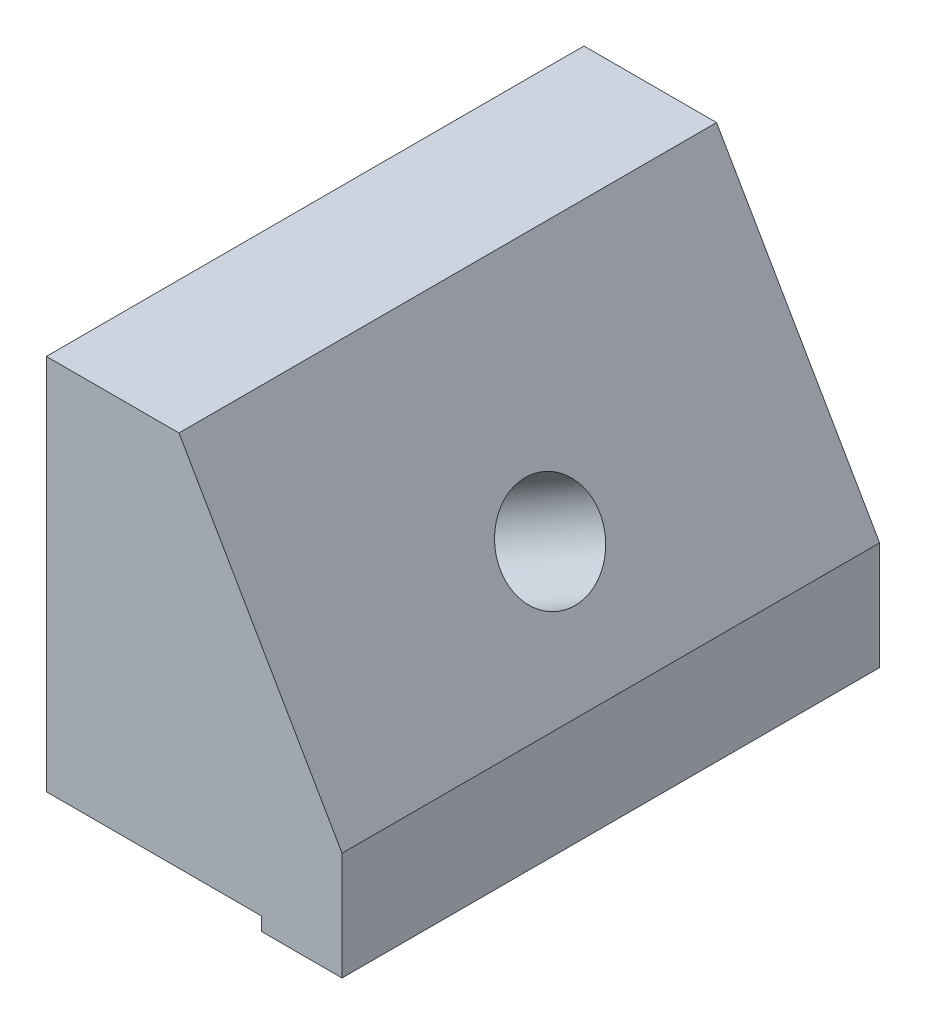
ISO-10303-21;
HEADER;
FILE_DESCRIPTION(('STEP AP214'),'2;1');
FILE_NAME('part.step','',(''),(''),'','','');
FILE_SCHEMA(('AUTOMOTIVE_DESIGN { 1 0 10303 214 1 1 1 1 }'));
ENDSEC;
DATA;
#1=APPLICATION_CONTEXT('core data for automotive mechanical design processes');
#2=APPLICATION_PROTOCOL_DEFINITION('international standard','automotive_design',2000,#1);
#3=PRODUCT_CONTEXT('',#1,'mechanical');
#4=PRODUCT('Part','Part','',(#3));
#5=PRODUCT_RELATED_PRODUCT_CATEGORY('part','',(#4));
#6=PRODUCT_DEFINITION_FORMATION('','',#4);
#7=PRODUCT_DEFINITION_CONTEXT('part definition',#1,'design');
#8=PRODUCT_DEFINITION('design','',#6,#7);
#9=PRODUCT_DEFINITION_SHAPE('','',#8);
#10=(LENGTH_UNIT() NAMED_UNIT(*) SI_UNIT(.MILLI.,.METRE.));
#11=(NAMED_UNIT(*) PLANE_ANGLE_UNIT() SI_UNIT($,.RADIAN.));
#12=(NAMED_UNIT(*) SI_UNIT($,.STERADIAN.) SOLID_ANGLE_UNIT());
#13=UNCERTAINTY_MEASURE_WITH_UNIT(LENGTH_MEASURE(1.E-05),#10,'distance_accuracy_value','');
#14=(GEOMETRIC_REPRESENTATION_CONTEXT(3) GLOBAL_UNCERTAINTY_ASSIGNED_CONTEXT((#13)) GLOBAL_UNIT_ASSIGNED_CONTEXT((#10,
#11,#12)) REPRESENTATION_CONTEXT('',''));
#15=CARTESIAN_POINT('',(0.,0.,0.));
#16=DIRECTION('',(0.,0.,1.));
#17=DIRECTION('',(1.,0.,0.));
#18=AXIS2_PLACEMENT_3D('',#15,#16,#17);
#19=CARTESIAN_POINT('',(-3.75,7.39519052838329,0.));
#20=DIRECTION('',(0.,1.,0.));
#21=DIRECTION('',(0.,0.,1.));
#22=AXIS2_PLACEMENT_3D('',#19,#20,#21);
#23=PLANE('',#22);
#24=DIRECTION('',(0.,0.,1.));
#25=VECTOR('',#24,1.);
#26=CARTESIAN_POINT('',(-3.75,7.39519052838329,0.));
#27=LINE('',#26,#25);
#28=CARTESIAN_POINT('',(-3.75,7.39519052838329,11.5059983692698));
#29=VERTEX_POINT('',#28);
#30=CARTESIAN_POINT('',(-3.75,7.39519052838329,13.));
#31=VERTEX_POINT('',#30);
#32=EDGE_CURVE('E277',#29,#31,#27,.T.);
#33=ORIENTED_EDGE('',*,*,#32,.F.);
#34=DIRECTION('',(1.,0.,0.));
#35=VECTOR('',#34,1.);
#36=CARTESIAN_POINT('',(-3.75,7.39519052838329,11.5059983692698));
#37=LINE('',#36,#35);
#38=CARTESIAN_POINT('',(0.250000000000003,7.39519052838329,11.5059983692698));
#39=VERTEX_POINT('',#38);
#40=EDGE_CURVE('E12',#29,#39,#37,.T.);
#41=ORIENTED_EDGE('',*,*,#40,.T.);
#42=DIRECTION('',(0.,0.,1.));
#43=VECTOR('',#42,1.);
#44=CARTESIAN_POINT('',(0.250000000000003,7.39519052838329,0.));
#45=LINE('',#44,#43);
#46=CARTESIAN_POINT('',(0.250000000000003,7.39519052838329,13.));
#47=VERTEX_POINT('',#46);
#48=EDGE_CURVE('E290',#39,#47,#45,.T.);
#49=ORIENTED_EDGE('',*,*,#48,.T.);
#50=DIRECTION('',(-1.,0.,0.));
#51=VECTOR('',#50,1.);
#52=CARTESIAN_POINT('',(-3.75,7.39519052838329,13.));
#53=LINE('',#52,#51);
#54=EDGE_CURVE('E280',#47,#31,#53,.T.);
#55=ORIENTED_EDGE('',*,*,#54,.T.);
#56=EDGE_LOOP('',(#33,#41,#49,#55));
#57=FACE_BOUND('',#56,.T.);
#58=ADVANCED_FACE('F42',(#57),#23,.F.);
#59=CARTESIAN_POINT('',(12.9903810567666,7.5,20.));
#60=DIRECTION('',(-0.866025403784438,-0.5,0.));
#61=DIRECTION('',(0.5,-0.866025403784438,0.));
#62=AXIS2_PLACEMENT_3D('',#59,#60,#61);
#63=PLANE('',#62);
#64=CARTESIAN_POINT('',(8.99038105676658,14.4282032302755,10.));
#65=DIRECTION('',(0.866025403784438,0.5,0.));
#66=DIRECTION('',(-0.5,0.866025403784439,0.));
#67=AXIS2_PLACEMENT_3D('',#64,#65,#66);
#68=CIRCLE('',#67,1.85);
#69=CARTESIAN_POINT('',(8.06538105676657,16.0303502272767,10.));
#70=VERTEX_POINT('',#69);
#71=EDGE_CURVE('E321',#70,#70,#68,.T.);
#72=ORIENTED_EDGE('',*,*,#71,.F.);
#73=EDGE_LOOP('',(#72));
#74=FACE_BOUND('',#73,.T.);
#75=DIRECTION('',(-0.5,0.866025403784439,0.));
#76=VECTOR('',#75,1.);
#77=CARTESIAN_POINT('',(12.9903810567666,7.5,0.));
#78=LINE('',#77,#76);
#79=CARTESIAN_POINT('',(11.25,10.5144284148501,0.));
#80=VERTEX_POINT('',#79);
#81=CARTESIAN_POINT('',(5.18317671461293,21.0224745856825,0.));
#82=VERTEX_POINT('',#81);
#83=EDGE_CURVE('E326',#80,#82,#78,.T.);
#84=ORIENTED_EDGE('',*,*,#83,.T.);
#85=DIRECTION('',(0.,0.,1.));
#86=VECTOR('',#85,1.);
#87=CARTESIAN_POINT('',(5.18317671461293,21.0224745856825,0.));
#88=LINE('',#87,#86);
#89=CARTESIAN_POINT('',(5.18317671461293,21.0224745856825,20.));
#90=VERTEX_POINT('',#89);
#91=EDGE_CURVE('E377',#82,#90,#88,.T.);
#92=ORIENTED_EDGE('',*,*,#91,.T.);
#93=DIRECTION('',(-0.5,0.866025403784439,0.));
#94=VECTOR('',#93,1.);
#95=CARTESIAN_POINT('',(12.9903810567666,7.5,20.));
#96=LINE('',#95,#94);
#97=CARTESIAN_POINT('',(11.25,10.5144284148501,20.));
#98=VERTEX_POINT('',#97);
#99=EDGE_CURVE('E330',#98,#90,#96,.T.);
#100=ORIENTED_EDGE('',*,*,#99,.F.);
#101=DIRECTION('',(0.,0.,1.));
#102=VECTOR('',#101,1.);
#103=CARTESIAN_POINT('',(11.25,10.5144284148501,0.));
#104=LINE('',#103,#102);
#105=EDGE_CURVE('E311',#80,#98,#104,.T.);
#106=ORIENTED_EDGE('',*,*,#105,.F.);
#107=EDGE_LOOP('',(#84,#92,#100,#106));
#108=FACE_BOUND('',#107,.T.);
#109=ADVANCED_FACE('F44',(#74,#108),#63,.F.);
#110=CARTESIAN_POINT('',(0.,0.,20.));
#111=DIRECTION('',(0.,0.,1.));
#112=DIRECTION('',(1.,0.,0.));
#113=AXIS2_PLACEMENT_3D('',#110,#111,#112);
#114=PLANE('',#113);
#115=DIRECTION('',(-1.,0.,0.));
#116=VECTOR('',#115,1.);
#117=CARTESIAN_POINT('',(0.250000000000003,6.99519052838329,20.));
#118=LINE('',#117,#116);
#119=CARTESIAN_POINT('',(8.25,6.99519052838329,20.));
#120=VERTEX_POINT('',#119);
#121=CARTESIAN_POINT('',(0.250000000000003,6.99519052838329,20.));
#122=VERTEX_POINT('',#121);
#123=EDGE_CURVE('E361',#120,#122,#118,.T.);
#124=ORIENTED_EDGE('',*,*,#123,.F.);
#125=DIRECTION('',(0.,1.,0.));
#126=VECTOR('',#125,1.);
#127=CARTESIAN_POINT('',(8.25,6.49519052838329,20.));
#128=LINE('',#127,#126);
#129=CARTESIAN_POINT('',(8.25,6.49519052838329,20.));
#130=VERTEX_POINT('',#129);
#131=EDGE_CURVE('E381',#130,#120,#128,.T.);
#132=ORIENTED_EDGE('',*,*,#131,.F.);
#133=DIRECTION('',(1.,0.,0.));
#134=VECTOR('',#133,1.);
#135=CARTESIAN_POINT('',(-3.75,6.49519052838329,20.));
#136=LINE('',#135,#134);
#137=CARTESIAN_POINT('',(11.25,6.49519052838329,20.));
#138=VERTEX_POINT('',#137);
#139=EDGE_CURVE('E304',#130,#138,#136,.T.);
#140=ORIENTED_EDGE('',*,*,#139,.T.);
#141=DIRECTION('',(0.,1.,0.));
#142=VECTOR('',#141,1.);
#143=CARTESIAN_POINT('',(11.25,6.49519052838329,20.));
#144=LINE('',#143,#142);
#145=EDGE_CURVE('E300',#138,#98,#144,.T.);
#146=ORIENTED_EDGE('',*,*,#145,.T.);
#147=ORIENTED_EDGE('',*,*,#99,.T.);
#148=DIRECTION('',(1.,0.,0.));
#149=VECTOR('',#148,1.);
#150=CARTESIAN_POINT('',(0.250000000000001,21.0224745856825,20.));
#151=LINE('',#150,#149);
#152=CARTESIAN_POINT('',(0.250000000000001,21.0224745856825,20.));
#153=VERTEX_POINT('',#152);
#154=EDGE_CURVE('E374',#153,#90,#151,.T.);
#155=ORIENTED_EDGE('',*,*,#154,.F.);
#156=DIRECTION('',(0.,1.,0.));
#157=VECTOR('',#156,1.);
#158=CARTESIAN_POINT('',(0.25,26.7024499500202,20.));
#159=LINE('',#158,#157);
#160=EDGE_CURVE('E288',#122,#153,#159,.T.);
#161=ORIENTED_EDGE('',*,*,#160,.F.);
#162=EDGE_LOOP('',(#124,#132,#140,#146,#147,#155,#161));
#163=FACE_BOUND('',#162,.T.);
#164=ADVANCED_FACE('F273',(#163),#114,.T.);
#165=CARTESIAN_POINT('',(0.,0.,0.));
#166=DIRECTION('',(0.,0.,1.));
#167=DIRECTION('',(1.,0.,0.));
#168=AXIS2_PLACEMENT_3D('',#165,#166,#167);
#169=PLANE('',#168);
#170=DIRECTION('',(0.,1.,0.));
#171=VECTOR('',#170,1.);
#172=CARTESIAN_POINT('',(8.25,6.49519052838329,0.));
#173=LINE('',#172,#171);
#174=CARTESIAN_POINT('',(8.25,6.49519052838329,0.));
#175=VERTEX_POINT('',#174);
#176=CARTESIAN_POINT('',(8.25,6.99519052838329,0.));
#177=VERTEX_POINT('',#176);
#178=EDGE_CURVE('E430',#175,#177,#173,.T.);
#179=ORIENTED_EDGE('',*,*,#178,.T.);
#180=DIRECTION('',(-1.,0.,0.));
#181=VECTOR('',#180,1.);
#182=CARTESIAN_POINT('',(0.250000000000003,6.99519052838329,0.));
#183=LINE('',#182,#181);
#184=CARTESIAN_POINT('',(0.250000000000003,6.99519052838329,0.));
#185=VERTEX_POINT('',#184);
#186=EDGE_CURVE('E368',#177,#185,#183,.T.);
#187=ORIENTED_EDGE('',*,*,#186,.T.);
#188=DIRECTION('',(0.,1.,0.));
#189=VECTOR('',#188,1.);
#190=CARTESIAN_POINT('',(0.25,26.7024499500202,0.));
#191=LINE('',#190,#189);
#192=CARTESIAN_POINT('',(0.250000000000001,21.0224745856825,0.));
#193=VERTEX_POINT('',#192);
#194=EDGE_CURVE('E346',#185,#193,#191,.T.);
#195=ORIENTED_EDGE('',*,*,#194,.T.);
#196=DIRECTION('',(1.,0.,0.));
#197=VECTOR('',#196,1.);
#198=CARTESIAN_POINT('',(0.250000000000001,21.0224745856825,0.));
#199=LINE('',#198,#197);
#200=EDGE_CURVE('E369',#193,#82,#199,.T.);
#201=ORIENTED_EDGE('',*,*,#200,.T.);
#202=ORIENTED_EDGE('',*,*,#83,.F.);
#203=DIRECTION('',(0.,1.,0.));
#204=VECTOR('',#203,1.);
#205=CARTESIAN_POINT('',(11.25,6.49519052838329,0.));
#206=LINE('',#205,#204);
#207=CARTESIAN_POINT('',(11.25,6.49519052838329,0.));
#208=VERTEX_POINT('',#207);
#209=EDGE_CURVE('E299',#208,#80,#206,.T.);
#210=ORIENTED_EDGE('',*,*,#209,.F.);
#211=DIRECTION('',(1.,0.,0.));
#212=VECTOR('',#211,1.);
#213=CARTESIAN_POINT('',(-3.75,6.49519052838329,0.));
#214=LINE('',#213,#212);
#215=EDGE_CURVE('E296',#175,#208,#214,.T.);
#216=ORIENTED_EDGE('',*,*,#215,.F.);
#217=EDGE_LOOP('',(#179,#187,#195,#201,#202,#210,#216));
#218=FACE_BOUND('',#217,.T.);
#219=ADVANCED_FACE('F434',(#218),#169,.F.);
#220=CARTESIAN_POINT('',(-13.375,1.51554445662277,10.));
#221=DIRECTION('',(0.866025403784439,0.5,0.));
#222=DIRECTION('',(-0.5,0.866025403784438,0.));
#223=AXIS2_PLACEMENT_3D('',#220,#221,#222);
#224=CYLINDRICAL_SURFACE('',#223,1.125);
#225=CARTESIAN_POINT('',(-0.419872981077809,8.99519052838329,10.));
#226=DIRECTION('',(0.,1.,0.));
#227=DIRECTION('',(1.,0.,0.));
#228=AXIS2_PLACEMENT_3D('',#225,#226,#227);
#229=ELLIPSE('',#228,2.25,1.125);
#230=CARTESIAN_POINT('',(1.7126363541341,8.99519052838329,10.3587840350524));
#231=VERTEX_POINT('',#230);
#232=CARTESIAN_POINT('',(1.7126363541341,8.99519052838329,9.64121596494755));
#233=VERTEX_POINT('',#232);
#234=EDGE_CURVE('E206',#231,#233,#229,.F.);
#235=ORIENTED_EDGE('',*,*,#234,.T.);
#236=CARTESIAN_POINT('',(1.7126363541341,8.99519052838329,9.64121596494755));
#237=CARTESIAN_POINT('',(1.71983511216995,8.98794837620146,9.67055036186476));
#238=CARTESIAN_POINT('',(1.72619402285769,8.98161689764097,9.70030341076179));
#239=CARTESIAN_POINT('',(1.73714059274333,8.97078817170904,9.76046351455106));
#240=CARTESIAN_POINT('',(1.74172814570919,8.96629103434596,9.79087060855234));
#241=CARTESIAN_POINT('',(1.75248692693685,8.95577523451789,9.88104640997816));
#242=CARTESIAN_POINT('',(1.75607201054902,8.9523209212232,9.94146334965415));
#243=CARTESIAN_POINT('',(1.75592315514308,8.95246526607113,10.0616716861273));
#244=CARTESIAN_POINT('',(1.75226214223061,8.95599364897395,10.1214632890588));
#245=CARTESIAN_POINT('',(1.74150049026233,8.96651417365043,10.2106989236111));
#246=CARTESIAN_POINT('',(1.73693266403881,8.97099304744882,10.2407834606934));
#247=CARTESIAN_POINT('',(1.72606279533413,8.98174750153817,10.3003101177295));
#248=CARTESIAN_POINT('',(1.71976083406143,8.98802299769498,10.3297522676961));
#249=CARTESIAN_POINT('',(1.7126363541341,8.99519052838329,10.3587840350524));
#250=B_SPLINE_CURVE_WITH_KNOTS('',3,(#236,#237,#238,#239,#240,#241,#242,#243,#244,#245,#246,
#247,#248,#249),.UNSPECIFIED.,.F.,.F.,(4,2,2,2,2,2,4),(0.,0.0931310394863526,0.18626766336891,
0.367233092904823,0.546386511271815,0.638562582483938,0.730734337882146),.UNSPECIFIED.);
#251=EDGE_CURVE('E196',#233,#231,#250,.T.);
#252=ORIENTED_EDGE('',*,*,#251,.T.);
#253=EDGE_LOOP('',(#235,#252));
#254=FACE_BOUND('',#253,.T.);
#255=CARTESIAN_POINT('',(3.79422863405995,11.4282032302755,10.));
#256=DIRECTION('',(0.866025403784438,0.5,0.));
#257=DIRECTION('',(-0.5,0.866025403784439,0.));
#258=AXIS2_PLACEMENT_3D('',#255,#256,#257);
#259=CIRCLE('',#258,1.125);
#260=CARTESIAN_POINT('',(3.23172863405995,12.402481809533,10.));
#261=VERTEX_POINT('',#260);
#262=EDGE_CURVE('E314',#261,#261,#259,.T.);
#263=ORIENTED_EDGE('',*,*,#262,.T.);
#264=EDGE_LOOP('',(#263));
#265=FACE_BOUND('',#264,.T.);
#266=ADVANCED_FACE('F209',(#254,#265),#224,.F.);
#267=CARTESIAN_POINT('',(3.79422863405995,11.4282032302755,10.));
#268=DIRECTION('',(0.866025403784439,0.5,0.));
#269=DIRECTION('',(-0.5,0.866025403784439,0.));
#270=AXIS2_PLACEMENT_3D('',#267,#268,#269);
#271=CYLINDRICAL_SURFACE('',#270,1.85);
#272=CARTESIAN_POINT('',(3.79422863405995,11.4282032302755,10.));
#273=DIRECTION('',(0.866025403784438,0.5,0.));
#274=DIRECTION('',(-0.5,0.866025403784439,0.));
#275=AXIS2_PLACEMENT_3D('',#272,#273,#274);
#276=CIRCLE('',#275,1.85);
#277=CARTESIAN_POINT('',(2.86922863405994,13.0303502272767,10.));
#278=VERTEX_POINT('',#277);
#279=EDGE_CURVE('E322',#278,#278,#276,.T.);
#280=ORIENTED_EDGE('',*,*,#279,.F.);
#281=EDGE_LOOP('',(#280));
#282=FACE_BOUND('',#281,.T.);
#283=ORIENTED_EDGE('',*,*,#71,.T.);
#284=EDGE_LOOP('',(#283));
#285=FACE_BOUND('',#284,.T.);
#286=ADVANCED_FACE('F266',(#282,#285),#271,.F.);
#287=CARTESIAN_POINT('',(3.79422863405995,11.4282032302755,10.));
#288=DIRECTION('',(0.866025403784438,0.5,0.));
#289=DIRECTION('',(-0.5,0.866025403784439,0.));
#290=AXIS2_PLACEMENT_3D('',#287,#288,#289);
#291=PLANE('',#290);
#292=ORIENTED_EDGE('',*,*,#262,.F.);
#293=EDGE_LOOP('',(#292));
#294=FACE_BOUND('',#293,.T.);
#295=ORIENTED_EDGE('',*,*,#279,.T.);
#296=EDGE_LOOP('',(#295));
#297=FACE_BOUND('',#296,.T.);
#298=ADVANCED_FACE('F262',(#294,#297),#291,.T.);
#299=CARTESIAN_POINT('',(-3.75,6.49519052838329,0.));
#300=DIRECTION('',(-1.,0.,0.));
#301=DIRECTION('',(0.,-1.,0.));
#302=AXIS2_PLACEMENT_3D('',#299,#300,#301);
#303=PLANE('',#302);
#304=DIRECTION('',(0.,-1.,0.));
#305=VECTOR('',#304,1.);
#306=CARTESIAN_POINT('',(-3.75,8.99519052838329,11.5059983692698));
#307=LINE('',#306,#305);
#308=CARTESIAN_POINT('',(-3.75,8.99519052838329,11.5059983692698));
#309=VERTEX_POINT('',#308);
#310=EDGE_CURVE('E207',#309,#29,#307,.T.);
#311=ORIENTED_EDGE('',*,*,#310,.T.);
#312=ORIENTED_EDGE('',*,*,#32,.T.);
#313=DIRECTION('',(0.,1.,0.));
#314=VECTOR('',#313,1.);
#315=CARTESIAN_POINT('',(-3.75,6.49519052838329,13.));
#316=LINE('',#315,#314);
#317=CARTESIAN_POINT('',(-3.75,11.7024499500202,13.));
#318=VERTEX_POINT('',#317);
#319=EDGE_CURVE('E389',#31,#318,#316,.T.);
#320=ORIENTED_EDGE('',*,*,#319,.T.);
#321=DIRECTION('',(0.,0.,1.));
#322=VECTOR('',#321,1.);
#323=CARTESIAN_POINT('',(-3.75,11.7024499500202,0.));
#324=LINE('',#323,#322);
#325=CARTESIAN_POINT('',(-3.75,11.7024499500202,7.));
#326=VERTEX_POINT('',#325);
#327=EDGE_CURVE('E293',#326,#318,#324,.T.);
#328=ORIENTED_EDGE('',*,*,#327,.F.);
#329=DIRECTION('',(0.,1.,0.));
#330=VECTOR('',#329,1.);
#331=CARTESIAN_POINT('',(-3.75,6.49519052838329,7.));
#332=LINE('',#331,#330);
#333=CARTESIAN_POINT('',(-3.75,7.39519052838329,7.));
#334=VERTEX_POINT('',#333);
#335=EDGE_CURVE('E388',#334,#326,#332,.T.);
#336=ORIENTED_EDGE('',*,*,#335,.F.);
#337=CARTESIAN_POINT('',(-3.75,7.39519052838329,8.49400163073024));
#338=VERTEX_POINT('',#337);
#339=EDGE_CURVE('E187',#334,#338,#27,.T.);
#340=ORIENTED_EDGE('',*,*,#339,.T.);
#341=DIRECTION('',(0.,-1.,0.));
#342=VECTOR('',#341,1.);
#343=CARTESIAN_POINT('',(-3.75,8.99519052838329,8.49400163073024));
#344=LINE('',#343,#342);
#345=CARTESIAN_POINT('',(-3.75,8.99519052838329,8.49400163073024));
#346=VERTEX_POINT('',#345);
#347=EDGE_CURVE('E166',#346,#338,#344,.T.);
#348=ORIENTED_EDGE('',*,*,#347,.F.);
#349=DIRECTION('',(0.,0.,-1.));
#350=VECTOR('',#349,1.);
#351=CARTESIAN_POINT('',(-3.75,8.99519052838329,11.5059983692698));
#352=LINE('',#351,#350);
#353=EDGE_CURVE('E171',#309,#346,#352,.T.);
#354=ORIENTED_EDGE('',*,*,#353,.F.);
#355=EDGE_LOOP('',(#311,#312,#320,#328,#336,#340,#348,#354));
#356=FACE_BOUND('',#355,.T.);
#357=ADVANCED_FACE('F184',(#356),#303,.T.);
#358=CARTESIAN_POINT('',(-3.75,6.49519052838329,0.));
#359=DIRECTION('',(0.,-1.,0.));
#360=DIRECTION('',(0.,0.,-1.));
#361=AXIS2_PLACEMENT_3D('',#358,#359,#360);
#362=PLANE('',#361);
#363=DIRECTION('',(0.,0.,1.));
#364=VECTOR('',#363,1.);
#365=CARTESIAN_POINT('',(8.25,6.49519052838329,0.));
#366=LINE('',#365,#364);
#367=EDGE_CURVE('E365',#175,#130,#366,.T.);
#368=ORIENTED_EDGE('',*,*,#367,.F.);
#369=ORIENTED_EDGE('',*,*,#215,.T.);
#370=DIRECTION('',(0.,0.,1.));
#371=VECTOR('',#370,1.);
#372=CARTESIAN_POINT('',(11.25,6.49519052838329,0.));
#373=LINE('',#372,#371);
#374=EDGE_CURVE('E303',#208,#138,#373,.T.);
#375=ORIENTED_EDGE('',*,*,#374,.T.);
#376=ORIENTED_EDGE('',*,*,#139,.F.);
#377=EDGE_LOOP('',(#368,#369,#375,#376));
#378=FACE_BOUND('',#377,.T.);
#379=ADVANCED_FACE('F257',(#378),#362,.T.);
#380=CARTESIAN_POINT('',(11.25,6.49519052838329,0.));
#381=DIRECTION('',(1.,0.,0.));
#382=DIRECTION('',(0.,0.,-1.));
#383=AXIS2_PLACEMENT_3D('',#380,#381,#382);
#384=PLANE('',#383);
#385=ORIENTED_EDGE('',*,*,#145,.F.);
#386=ORIENTED_EDGE('',*,*,#374,.F.);
#387=ORIENTED_EDGE('',*,*,#209,.T.);
#388=ORIENTED_EDGE('',*,*,#105,.T.);
#389=EDGE_LOOP('',(#385,#386,#387,#388));
#390=FACE_BOUND('',#389,.T.);
#391=ADVANCED_FACE('F250',(#390),#384,.T.);
#392=CARTESIAN_POINT('',(0.25,26.7024499500202,0.));
#393=DIRECTION('',(1.,0.,0.));
#394=DIRECTION('',(0.,1.,0.));
#395=AXIS2_PLACEMENT_3D('',#392,#393,#394);
#396=PLANE('',#395);
#397=ORIENTED_EDGE('',*,*,#48,.F.);
#398=DIRECTION('',(0.,-1.,0.));
#399=VECTOR('',#398,1.);
#400=CARTESIAN_POINT('',(0.250000000000003,8.99519052838329,11.5059983692698));
#401=LINE('',#400,#399);
#402=CARTESIAN_POINT('',(0.250000000000003,6.99519052838329,11.5059983692698));
#403=VERTEX_POINT('',#402);
#404=EDGE_CURVE('E340',#39,#403,#401,.T.);
#405=ORIENTED_EDGE('',*,*,#404,.T.);
#406=DIRECTION('',(0.,0.,1.));
#407=VECTOR('',#406,1.);
#408=CARTESIAN_POINT('',(0.250000000000003,6.99519052838329,0.));
#409=LINE('',#408,#407);
#410=EDGE_CURVE('E351',#403,#122,#409,.T.);
#411=ORIENTED_EDGE('',*,*,#410,.T.);
#412=ORIENTED_EDGE('',*,*,#160,.T.);
#413=DIRECTION('',(0.,0.,1.));
#414=VECTOR('',#413,1.);
#415=CARTESIAN_POINT('',(0.250000000000001,21.0224745856825,0.));
#416=LINE('',#415,#414);
#417=EDGE_CURVE('E373',#193,#153,#416,.T.);
#418=ORIENTED_EDGE('',*,*,#417,.F.);
#419=ORIENTED_EDGE('',*,*,#194,.F.);
#420=CARTESIAN_POINT('',(0.250000000000003,6.99519052838329,8.49400163073024));
#421=VERTEX_POINT('',#420);
#422=EDGE_CURVE('E343',#185,#421,#409,.T.);
#423=ORIENTED_EDGE('',*,*,#422,.T.);
#424=DIRECTION('',(0.,-1.,0.));
#425=VECTOR('',#424,1.);
#426=CARTESIAN_POINT('',(0.250000000000003,8.99519052838329,8.49400163073024));
#427=LINE('',#426,#425);
#428=CARTESIAN_POINT('',(0.250000000000003,7.39519052838329,8.49400163073024));
#429=VERTEX_POINT('',#428);
#430=EDGE_CURVE('E66',#429,#421,#427,.T.);
#431=ORIENTED_EDGE('',*,*,#430,.F.);
#432=CARTESIAN_POINT('',(0.250000000000001,7.39519052838329,7.));
#433=VERTEX_POINT('',#432);
#434=EDGE_CURVE('E284',#433,#429,#45,.T.);
#435=ORIENTED_EDGE('',*,*,#434,.F.);
#436=DIRECTION('',(0.,1.,0.));
#437=VECTOR('',#436,1.);
#438=CARTESIAN_POINT('',(0.250000000000001,6.49519052838329,7.));
#439=LINE('',#438,#437);
#440=CARTESIAN_POINT('',(0.250000000000001,11.7024499500202,7.));
#441=VERTEX_POINT('',#440);
#442=EDGE_CURVE('E356',#433,#441,#439,.T.);
#443=ORIENTED_EDGE('',*,*,#442,.T.);
#444=DIRECTION('',(0.,0.,1.));
#445=VECTOR('',#444,1.);
#446=CARTESIAN_POINT('',(0.250000000000002,11.7024499500202,0.));
#447=LINE('',#446,#445);
#448=CARTESIAN_POINT('',(0.250000000000001,11.7024499500202,13.));
#449=VERTEX_POINT('',#448);
#450=EDGE_CURVE('E307',#441,#449,#447,.T.);
#451=ORIENTED_EDGE('',*,*,#450,.T.);
#452=DIRECTION('',(0.,1.,0.));
#453=VECTOR('',#452,1.);
#454=CARTESIAN_POINT('',(0.250000000000001,6.49519052838329,13.));
#455=LINE('',#454,#453);
#456=EDGE_CURVE('E387',#47,#449,#455,.T.);
#457=ORIENTED_EDGE('',*,*,#456,.F.);
#458=EDGE_LOOP('',(#397,#405,#411,#412,#418,#419,#423,#431,#435,#443,#451,#457));
#459=FACE_BOUND('',#458,.T.);
#460=ADVANCED_FACE('F246',(#459),#396,.F.);
#461=CARTESIAN_POINT('',(0.250000000000002,11.7024499500202,0.));
#462=DIRECTION('',(0.,-1.,0.));
#463=DIRECTION('',(0.,0.,-1.));
#464=AXIS2_PLACEMENT_3D('',#461,#462,#463);
#465=PLANE('',#464);
#466=ORIENTED_EDGE('',*,*,#327,.T.);
#467=DIRECTION('',(-1.,0.,0.));
#468=VECTOR('',#467,1.);
#469=CARTESIAN_POINT('',(-3.75,11.7024499500202,13.));
#470=LINE('',#469,#468);
#471=EDGE_CURVE('E384',#449,#318,#470,.T.);
#472=ORIENTED_EDGE('',*,*,#471,.F.);
#473=ORIENTED_EDGE('',*,*,#450,.F.);
#474=DIRECTION('',(1.,0.,0.));
#475=VECTOR('',#474,1.);
#476=CARTESIAN_POINT('',(-3.75,11.7024499500202,7.));
#477=LINE('',#476,#475);
#478=EDGE_CURVE('E350',#326,#441,#477,.T.);
#479=ORIENTED_EDGE('',*,*,#478,.F.);
#480=EDGE_LOOP('',(#466,#472,#473,#479));
#481=FACE_BOUND('',#480,.T.);
#482=ADVANCED_FACE('F243',(#481),#465,.F.);
#483=ORIENTED_EDGE('',*,*,#434,.T.);
#484=DIRECTION('',(-1.,0.,0.));
#485=VECTOR('',#484,1.);
#486=CARTESIAN_POINT('',(-3.75,7.39519052838329,8.49400163073024));
#487=LINE('',#486,#485);
#488=EDGE_CURVE('E51',#429,#338,#487,.T.);
#489=ORIENTED_EDGE('',*,*,#488,.T.);
#490=ORIENTED_EDGE('',*,*,#339,.F.);
#491=DIRECTION('',(1.,0.,0.));
#492=VECTOR('',#491,1.);
#493=CARTESIAN_POINT('',(-3.75,7.39519052838329,7.));
#494=LINE('',#493,#492);
#495=EDGE_CURVE('E392',#334,#433,#494,.T.);
#496=ORIENTED_EDGE('',*,*,#495,.T.);
#497=EDGE_LOOP('',(#483,#489,#490,#496));
#498=FACE_BOUND('',#497,.T.);
#499=ADVANCED_FACE('F241',(#498),#23,.F.);
#500=CARTESIAN_POINT('',(-3.75,6.49519052838329,7.));
#501=DIRECTION('',(0.,0.,1.));
#502=DIRECTION('',(1.,0.,0.));
#503=AXIS2_PLACEMENT_3D('',#500,#501,#502);
#504=PLANE('',#503);
#505=ORIENTED_EDGE('',*,*,#335,.T.);
#506=ORIENTED_EDGE('',*,*,#478,.T.);
#507=ORIENTED_EDGE('',*,*,#442,.F.);
#508=ORIENTED_EDGE('',*,*,#495,.F.);
#509=EDGE_LOOP('',(#505,#506,#507,#508));
#510=FACE_BOUND('',#509,.T.);
#511=ADVANCED_FACE('F237',(#510),#504,.F.);
#512=CARTESIAN_POINT('',(-3.75,6.49519052838329,13.));
#513=DIRECTION('',(0.,0.,-1.));
#514=DIRECTION('',(-1.,0.,0.));
#515=AXIS2_PLACEMENT_3D('',#512,#513,#514);
#516=PLANE('',#515);
#517=ORIENTED_EDGE('',*,*,#456,.T.);
#518=ORIENTED_EDGE('',*,*,#471,.T.);
#519=ORIENTED_EDGE('',*,*,#319,.F.);
#520=ORIENTED_EDGE('',*,*,#54,.F.);
#521=EDGE_LOOP('',(#517,#518,#519,#520));
#522=FACE_BOUND('',#521,.T.);
#523=ADVANCED_FACE('F233',(#522),#516,.F.);
#524=CARTESIAN_POINT('',(0.250000000000001,21.0224745856825,0.));
#525=DIRECTION('',(0.,-1.,0.));
#526=DIRECTION('',(1.,0.,0.));
#527=AXIS2_PLACEMENT_3D('',#524,#525,#526);
#528=PLANE('',#527);
#529=ORIENTED_EDGE('',*,*,#154,.T.);
#530=ORIENTED_EDGE('',*,*,#91,.F.);
#531=ORIENTED_EDGE('',*,*,#200,.F.);
#532=ORIENTED_EDGE('',*,*,#417,.T.);
#533=EDGE_LOOP('',(#529,#530,#531,#532));
#534=FACE_BOUND('',#533,.T.);
#535=ADVANCED_FACE('F226',(#534),#528,.F.);
#536=CARTESIAN_POINT('',(0.250000000000003,6.99519052838329,0.));
#537=DIRECTION('',(0.,1.,0.));
#538=DIRECTION('',(0.,0.,1.));
#539=AXIS2_PLACEMENT_3D('',#536,#537,#538);
#540=PLANE('',#539);
#541=ORIENTED_EDGE('',*,*,#410,.F.);
#542=CARTESIAN_POINT('',(0.250000000000003,6.99519052838329,10.));
#543=DIRECTION('',(0.,-1.,0.));
#544=DIRECTION('',(0.,0.,1.));
#545=AXIS2_PLACEMENT_3D('',#542,#543,#544);
#546=CIRCLE('',#545,1.50599836926977);
#547=EDGE_CURVE('E181',#421,#403,#546,.T.);
#548=ORIENTED_EDGE('',*,*,#547,.F.);
#549=ORIENTED_EDGE('',*,*,#422,.F.);
#550=ORIENTED_EDGE('',*,*,#186,.F.);
#551=DIRECTION('',(0.,0.,1.));
#552=VECTOR('',#551,1.);
#553=CARTESIAN_POINT('',(8.25,6.99519052838329,0.));
#554=LINE('',#553,#552);
#555=EDGE_CURVE('E358',#177,#120,#554,.T.);
#556=ORIENTED_EDGE('',*,*,#555,.T.);
#557=ORIENTED_EDGE('',*,*,#123,.T.);
#558=EDGE_LOOP('',(#541,#548,#549,#550,#556,#557));
#559=FACE_BOUND('',#558,.T.);
#560=ADVANCED_FACE('F222',(#559),#540,.F.);
#561=CARTESIAN_POINT('',(8.25,6.49519052838329,0.));
#562=DIRECTION('',(1.,0.,0.));
#563=DIRECTION('',(0.,0.,-1.));
#564=AXIS2_PLACEMENT_3D('',#561,#562,#563);
#565=PLANE('',#564);
#566=ORIENTED_EDGE('',*,*,#131,.T.);
#567=ORIENTED_EDGE('',*,*,#555,.F.);
#568=ORIENTED_EDGE('',*,*,#178,.F.);
#569=ORIENTED_EDGE('',*,*,#367,.T.);
#570=EDGE_LOOP('',(#566,#567,#568,#569));
#571=FACE_BOUND('',#570,.T.);
#572=ADVANCED_FACE('F225',(#571),#565,.F.);
#573=CARTESIAN_POINT('',(0.250000000000003,8.99519052838329,10.));
#574=DIRECTION('',(0.,1.,0.));
#575=DIRECTION('',(0.,0.,1.));
#576=AXIS2_PLACEMENT_3D('',#573,#574,#575);
#577=PLANE('',#576);
#578=CARTESIAN_POINT('',(0.250000000000003,8.99519052838329,10.));
#579=DIRECTION('',(0.,-1.,0.));
#580=DIRECTION('',(0.,0.,1.));
#581=AXIS2_PLACEMENT_3D('',#578,#579,#580);
#582=CIRCLE('',#581,1.50599836926977);
#583=CARTESIAN_POINT('',(0.250000000000003,8.99519052838329,11.5059983692698));
#584=VERTEX_POINT('',#583);
#585=EDGE_CURVE('E170',#231,#584,#582,.T.);
#586=ORIENTED_EDGE('',*,*,#585,.T.);
#587=DIRECTION('',(-1.,0.,0.));
#588=VECTOR('',#587,1.);
#589=CARTESIAN_POINT('',(-3.75,8.99519052838329,11.5059983692698));
#590=LINE('',#589,#588);
#591=EDGE_CURVE('E177',#584,#309,#590,.T.);
#592=ORIENTED_EDGE('',*,*,#591,.T.);
#593=ORIENTED_EDGE('',*,*,#353,.T.);
#594=DIRECTION('',(1.,0.,0.));
#595=VECTOR('',#594,1.);
#596=CARTESIAN_POINT('',(-3.75,8.99519052838329,8.49400163073024));
#597=LINE('',#596,#595);
#598=CARTESIAN_POINT('',(0.250000000000003,8.99519052838329,8.49400163073024));
#599=VERTEX_POINT('',#598);
#600=EDGE_CURVE('E162',#346,#599,#597,.T.);
#601=ORIENTED_EDGE('',*,*,#600,.T.);
#602=EDGE_CURVE('E58',#599,#233,#582,.T.);
#603=ORIENTED_EDGE('',*,*,#602,.T.);
#604=ORIENTED_EDGE('',*,*,#234,.F.);
#605=EDGE_LOOP('',(#586,#592,#593,#601,#603,#604));
#606=FACE_BOUND('',#605,.T.);
#607=ADVANCED_FACE('F175',(#606),#577,.F.);
#608=CARTESIAN_POINT('',(-3.75,8.99519052838329,11.5059983692698));
#609=DIRECTION('',(0.,0.,1.));
#610=DIRECTION('',(1.,0.,0.));
#611=AXIS2_PLACEMENT_3D('',#608,#609,#610);
#612=PLANE('',#611);
#613=ORIENTED_EDGE('',*,*,#310,.F.);
#614=ORIENTED_EDGE('',*,*,#591,.F.);
#615=EDGE_CURVE('E423',#584,#39,#401,.T.);
#616=ORIENTED_EDGE('',*,*,#615,.T.);
#617=ORIENTED_EDGE('',*,*,#40,.F.);
#618=EDGE_LOOP('',(#613,#614,#616,#617));
#619=FACE_BOUND('',#618,.T.);
#620=ADVANCED_FACE('F218',(#619),#612,.F.);
#621=CARTESIAN_POINT('',(-3.75,8.99519052838329,8.49400163073024));
#622=DIRECTION('',(0.,0.,-1.));
#623=DIRECTION('',(-1.,0.,0.));
#624=AXIS2_PLACEMENT_3D('',#621,#622,#623);
#625=PLANE('',#624);
#626=EDGE_CURVE('E168',#599,#429,#427,.T.);
#627=ORIENTED_EDGE('',*,*,#626,.F.);
#628=ORIENTED_EDGE('',*,*,#600,.F.);
#629=ORIENTED_EDGE('',*,*,#347,.T.);
#630=ORIENTED_EDGE('',*,*,#488,.F.);
#631=EDGE_LOOP('',(#627,#628,#629,#630));
#632=FACE_BOUND('',#631,.T.);
#633=ADVANCED_FACE('F164',(#632),#625,.F.);
#634=CARTESIAN_POINT('',(0.250000000000003,8.99519052838329,10.));
#635=DIRECTION('',(0.,-1.,0.));
#636=DIRECTION('',(0.,0.,-1.));
#637=AXIS2_PLACEMENT_3D('',#634,#635,#636);
#638=CYLINDRICAL_SURFACE('',#637,1.50599836926977);
#639=ORIENTED_EDGE('',*,*,#602,.F.);
#640=ORIENTED_EDGE('',*,*,#626,.T.);
#641=ORIENTED_EDGE('',*,*,#430,.T.);
#642=ORIENTED_EDGE('',*,*,#547,.T.);
#643=ORIENTED_EDGE('',*,*,#404,.F.);
#644=ORIENTED_EDGE('',*,*,#615,.F.);
#645=ORIENTED_EDGE('',*,*,#585,.F.);
#646=ORIENTED_EDGE('',*,*,#251,.F.);
#647=EDGE_LOOP('',(#639,#640,#641,#642,#643,#644,#645,#646));
#648=FACE_BOUND('',#647,.T.);
#649=ADVANCED_FACE('F213',(#648),#638,.F.);
#650=CLOSED_SHELL('',(#58,#109,#164,#219,#266,#286,#298,#357,#379,#391,#460,#482,#499,#511,#523,
#535,#560,#572,#607,#620,#633,#649));
#651=MANIFOLD_SOLID_BREP('B2',#650);
#652=ADVANCED_BREP_SHAPE_REPRESENTATION('',(#18,#651),#14);
#653=SHAPE_DEFINITION_REPRESENTATION(#9,#652);
ENDSEC;
END-ISO-10303-21;
